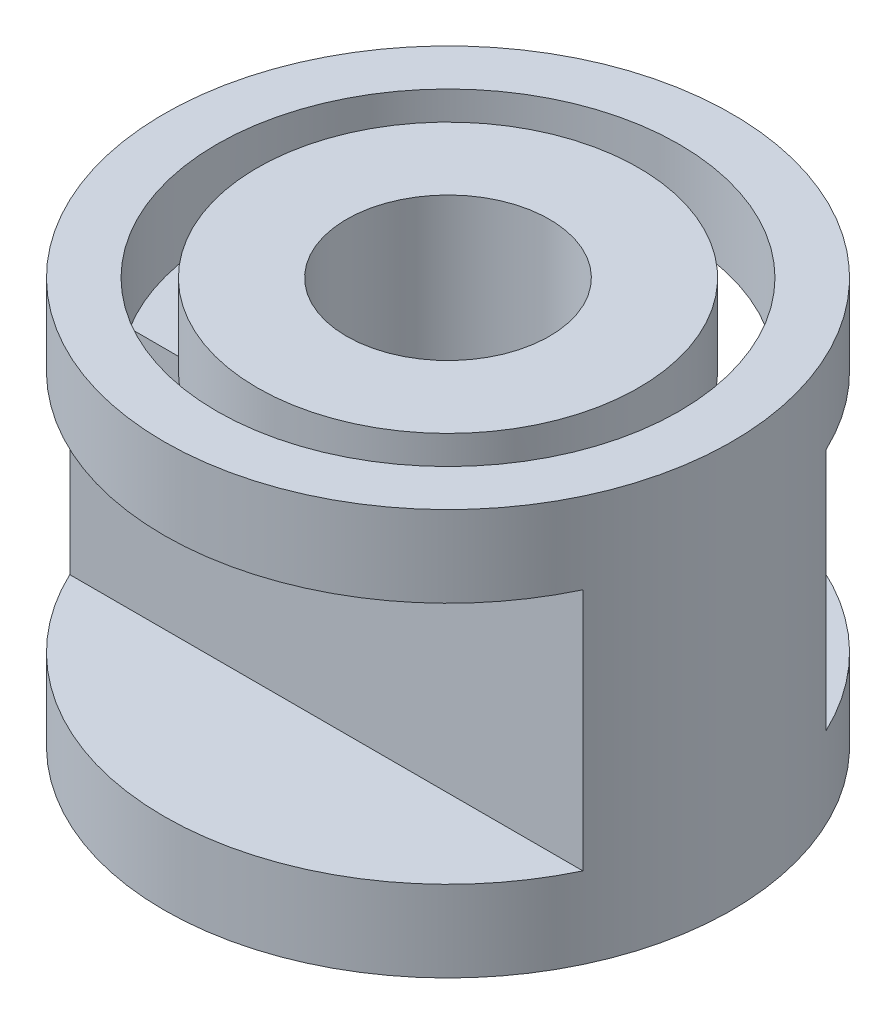
ISO-10303-21;
HEADER;
FILE_DESCRIPTION(('STEP AP214'),'2;1');
FILE_NAME('part.step','',(''),(''),'','','');
FILE_SCHEMA(('AUTOMOTIVE_DESIGN { 1 0 10303 214 1 1 1 1 }'));
ENDSEC;
DATA;
#1=APPLICATION_CONTEXT('core data for automotive mechanical design processes');
#2=APPLICATION_PROTOCOL_DEFINITION('international standard','automotive_design',2000,#1);
#3=PRODUCT_CONTEXT('',#1,'mechanical');
#4=PRODUCT('Part','Part','',(#3));
#5=PRODUCT_RELATED_PRODUCT_CATEGORY('part','',(#4));
#6=PRODUCT_DEFINITION_FORMATION('','',#4);
#7=PRODUCT_DEFINITION_CONTEXT('part definition',#1,'design');
#8=PRODUCT_DEFINITION('design','',#6,#7);
#9=PRODUCT_DEFINITION_SHAPE('','',#8);
#10=(LENGTH_UNIT() NAMED_UNIT(*) SI_UNIT(.MILLI.,.METRE.));
#11=(NAMED_UNIT(*) PLANE_ANGLE_UNIT() SI_UNIT($,.RADIAN.));
#12=(NAMED_UNIT(*) SI_UNIT($,.STERADIAN.) SOLID_ANGLE_UNIT());
#13=UNCERTAINTY_MEASURE_WITH_UNIT(LENGTH_MEASURE(1.E-05),#10,'distance_accuracy_value','');
#14=(GEOMETRIC_REPRESENTATION_CONTEXT(3) GLOBAL_UNCERTAINTY_ASSIGNED_CONTEXT((#13)) GLOBAL_UNIT_ASSIGNED_CONTEXT((#10,
#11,#12)) REPRESENTATION_CONTEXT('',''));
#15=CARTESIAN_POINT('',(0.,0.,0.));
#16=DIRECTION('',(0.,0.,1.));
#17=DIRECTION('',(1.,0.,0.));
#18=AXIS2_PLACEMENT_3D('',#15,#16,#17);
#19=CARTESIAN_POINT('',(0.,4.,0.));
#20=DIRECTION('',(0.,1.,0.));
#21=DIRECTION('',(0.,0.,1.));
#22=AXIS2_PLACEMENT_3D('',#19,#20,#21);
#23=PLANE('',#22);
#24=DIRECTION('',(1.,0.,0.));
#25=VECTOR('',#24,1.);
#26=CARTESIAN_POINT('',(-3.5,4.,-1.5));
#27=LINE('',#26,#25);
#28=CARTESIAN_POINT('',(-2.42332416321053,4.,-1.5));
#29=VERTEX_POINT('',#28);
#30=CARTESIAN_POINT('',(-1.80900525151256,4.,-1.5));
#31=VERTEX_POINT('',#30);
#32=EDGE_CURVE('E50',#29,#31,#27,.T.);
#33=ORIENTED_EDGE('',*,*,#32,.F.);
#34=CARTESIAN_POINT('',(0.,4.,0.));
#35=DIRECTION('',(0.,1.,0.));
#36=DIRECTION('',(0.,0.,1.));
#37=AXIS2_PLACEMENT_3D('',#34,#35,#36);
#38=CIRCLE('',#37,2.85);
#39=CARTESIAN_POINT('',(-2.42332416321053,4.,1.5));
#40=VERTEX_POINT('',#39);
#41=EDGE_CURVE('E153',#29,#40,#38,.T.);
#42=ORIENTED_EDGE('',*,*,#41,.T.);
#43=DIRECTION('',(1.,0.,0.));
#44=VECTOR('',#43,1.);
#45=CARTESIAN_POINT('',(-3.5,4.,1.5));
#46=LINE('',#45,#44);
#47=CARTESIAN_POINT('',(-1.80900525151256,4.,1.5));
#48=VERTEX_POINT('',#47);
#49=EDGE_CURVE('E336',#40,#48,#46,.T.);
#50=ORIENTED_EDGE('',*,*,#49,.T.);
#51=CARTESIAN_POINT('',(0.,4.,0.));
#52=DIRECTION('',(0.,1.,0.));
#53=DIRECTION('',(0.,0.,1.));
#54=AXIS2_PLACEMENT_3D('',#51,#52,#53);
#55=CIRCLE('',#54,2.35);
#56=EDGE_CURVE('E146',#31,#48,#55,.T.);
#57=ORIENTED_EDGE('',*,*,#56,.F.);
#58=EDGE_LOOP('',(#33,#42,#50,#57));
#59=FACE_BOUND('',#58,.T.);
#60=ADVANCED_FACE('F35',(#59),#23,.T.);
#61=CARTESIAN_POINT('',(1.80900525151256,4.,-1.5));
#62=VERTEX_POINT('',#61);
#63=CARTESIAN_POINT('',(2.42332416321053,4.,-1.5));
#64=VERTEX_POINT('',#63);
#65=EDGE_CURVE('E124',#62,#64,#27,.T.);
#66=ORIENTED_EDGE('',*,*,#65,.F.);
#67=CARTESIAN_POINT('',(1.80900525151255,4.,1.5));
#68=VERTEX_POINT('',#67);
#69=EDGE_CURVE('E141',#68,#62,#55,.T.);
#70=ORIENTED_EDGE('',*,*,#69,.F.);
#71=CARTESIAN_POINT('',(2.42332416321053,4.,1.5));
#72=VERTEX_POINT('',#71);
#73=EDGE_CURVE('E129',#68,#72,#46,.T.);
#74=ORIENTED_EDGE('',*,*,#73,.T.);
#75=EDGE_CURVE('E149',#72,#64,#38,.T.);
#76=ORIENTED_EDGE('',*,*,#75,.T.);
#77=EDGE_LOOP('',(#66,#70,#74,#76));
#78=FACE_BOUND('',#77,.T.);
#79=ADVANCED_FACE('F186',(#78),#23,.T.);
#80=CARTESIAN_POINT('',(0.,5.,0.));
#81=DIRECTION('',(0.,-1.,0.));
#82=DIRECTION('',(0.,0.,-1.));
#83=AXIS2_PLACEMENT_3D('',#80,#81,#82);
#84=CYLINDRICAL_SURFACE('',#83,3.5);
#85=DIRECTION('',(0.,-1.,0.));
#86=VECTOR('',#85,1.);
#87=CARTESIAN_POINT('',(3.16227766016838,5.,-1.5));
#88=LINE('',#87,#86);
#89=CARTESIAN_POINT('',(3.16227766016838,1.,-1.5));
#90=VERTEX_POINT('',#89);
#91=CARTESIAN_POINT('',(3.16227766016838,4.,-1.5));
#92=VERTEX_POINT('',#91);
#93=EDGE_CURVE('E43',#90,#92,#88,.F.);
#94=ORIENTED_EDGE('',*,*,#93,.T.);
#95=CARTESIAN_POINT('',(0.,4.,0.));
#96=DIRECTION('',(0.,1.,0.));
#97=DIRECTION('',(0.,0.,1.));
#98=AXIS2_PLACEMENT_3D('',#95,#96,#97);
#99=CIRCLE('',#98,3.5);
#100=CARTESIAN_POINT('',(-3.16227766016838,4.,-1.5));
#101=VERTEX_POINT('',#100);
#102=EDGE_CURVE('E102',#92,#101,#99,.T.);
#103=ORIENTED_EDGE('',*,*,#102,.T.);
#104=DIRECTION('',(0.,-1.,0.));
#105=VECTOR('',#104,1.);
#106=CARTESIAN_POINT('',(-3.16227766016838,5.,-1.5));
#107=LINE('',#106,#105);
#108=CARTESIAN_POINT('',(-3.16227766016838,1.,-1.5));
#109=VERTEX_POINT('',#108);
#110=EDGE_CURVE('E11',#101,#109,#107,.T.);
#111=ORIENTED_EDGE('',*,*,#110,.T.);
#112=CARTESIAN_POINT('',(0.,1.,0.));
#113=DIRECTION('',(0.,-1.,0.));
#114=DIRECTION('',(0.,0.,-1.));
#115=AXIS2_PLACEMENT_3D('',#112,#113,#114);
#116=CIRCLE('',#115,3.5);
#117=EDGE_CURVE('E173',#109,#90,#116,.T.);
#118=ORIENTED_EDGE('',*,*,#117,.T.);
#119=EDGE_LOOP('',(#94,#103,#111,#118));
#120=FACE_BOUND('',#119,.T.);
#121=CARTESIAN_POINT('',(0.,4.,0.));
#122=DIRECTION('',(0.,1.,0.));
#123=DIRECTION('',(0.,0.,1.));
#124=AXIS2_PLACEMENT_3D('',#121,#122,#123);
#125=CIRCLE('',#124,3.5);
#126=CARTESIAN_POINT('',(-3.16227766016838,4.,1.5));
#127=VERTEX_POINT('',#126);
#128=CARTESIAN_POINT('',(3.16227766016838,4.,1.5));
#129=VERTEX_POINT('',#128);
#130=EDGE_CURVE('E171',#127,#129,#125,.T.);
#131=ORIENTED_EDGE('',*,*,#130,.T.);
#132=DIRECTION('',(0.,-1.,0.));
#133=VECTOR('',#132,1.);
#134=CARTESIAN_POINT('',(3.16227766016838,5.,1.5));
#135=LINE('',#134,#133);
#136=CARTESIAN_POINT('',(3.16227766016838,1.,1.5));
#137=VERTEX_POINT('',#136);
#138=EDGE_CURVE('E168',#129,#137,#135,.T.);
#139=ORIENTED_EDGE('',*,*,#138,.T.);
#140=CARTESIAN_POINT('',(0.,1.,0.));
#141=DIRECTION('',(0.,-1.,0.));
#142=DIRECTION('',(0.,0.,-1.));
#143=AXIS2_PLACEMENT_3D('',#140,#141,#142);
#144=CIRCLE('',#143,3.5);
#145=CARTESIAN_POINT('',(-3.16227766016838,1.,1.5));
#146=VERTEX_POINT('',#145);
#147=EDGE_CURVE('E160',#137,#146,#144,.T.);
#148=ORIENTED_EDGE('',*,*,#147,.T.);
#149=DIRECTION('',(0.,-1.,0.));
#150=VECTOR('',#149,1.);
#151=CARTESIAN_POINT('',(-3.16227766016838,5.,1.5));
#152=LINE('',#151,#150);
#153=EDGE_CURVE('E165',#146,#127,#152,.F.);
#154=ORIENTED_EDGE('',*,*,#153,.T.);
#155=EDGE_LOOP('',(#131,#139,#148,#154));
#156=FACE_BOUND('',#155,.T.);
#157=CARTESIAN_POINT('',(0.,5.,0.));
#158=DIRECTION('',(0.,1.,0.));
#159=DIRECTION('',(0.,0.,1.));
#160=AXIS2_PLACEMENT_3D('',#157,#158,#159);
#161=CIRCLE('',#160,3.5);
#162=CARTESIAN_POINT('',(0.,5.,3.5));
#163=VERTEX_POINT('',#162);
#164=EDGE_CURVE('E157',#163,#163,#161,.T.);
#165=ORIENTED_EDGE('',*,*,#164,.F.);
#166=EDGE_LOOP('',(#165));
#167=FACE_BOUND('',#166,.T.);
#168=CARTESIAN_POINT('',(0.,0.,0.));
#169=DIRECTION('',(0.,1.,0.));
#170=DIRECTION('',(0.,0.,1.));
#171=AXIS2_PLACEMENT_3D('',#168,#169,#170);
#172=CIRCLE('',#171,3.5);
#173=CARTESIAN_POINT('',(0.,0.,3.5));
#174=VERTEX_POINT('',#173);
#175=EDGE_CURVE('E152',#174,#174,#172,.T.);
#176=ORIENTED_EDGE('',*,*,#175,.T.);
#177=EDGE_LOOP('',(#176));
#178=FACE_BOUND('',#177,.T.);
#179=ADVANCED_FACE('F37',(#120,#156,#167,#178),#84,.T.);
#180=CARTESIAN_POINT('',(0.,5.,0.));
#181=DIRECTION('',(0.,1.,0.));
#182=DIRECTION('',(0.,0.,1.));
#183=AXIS2_PLACEMENT_3D('',#180,#181,#182);
#184=PLANE('',#183);
#185=CARTESIAN_POINT('',(0.,5.,0.));
#186=DIRECTION('',(0.,1.,0.));
#187=DIRECTION('',(0.,0.,1.));
#188=AXIS2_PLACEMENT_3D('',#185,#186,#187);
#189=CIRCLE('',#188,2.85);
#190=CARTESIAN_POINT('',(0.,5.,2.85));
#191=VERTEX_POINT('',#190);
#192=EDGE_CURVE('E144',#191,#191,#189,.T.);
#193=ORIENTED_EDGE('',*,*,#192,.F.);
#194=EDGE_LOOP('',(#193));
#195=FACE_BOUND('',#194,.T.);
#196=ORIENTED_EDGE('',*,*,#164,.T.);
#197=EDGE_LOOP('',(#196));
#198=FACE_BOUND('',#197,.T.);
#199=ADVANCED_FACE('F202',(#195,#198),#184,.T.);
#200=CARTESIAN_POINT('',(0.,0.,0.));
#201=DIRECTION('',(0.,1.,0.));
#202=DIRECTION('',(0.,0.,1.));
#203=AXIS2_PLACEMENT_3D('',#200,#201,#202);
#204=PLANE('',#203);
#205=CARTESIAN_POINT('',(0.,0.,0.));
#206=DIRECTION('',(0.,1.,0.));
#207=DIRECTION('',(0.,0.,1.));
#208=AXIS2_PLACEMENT_3D('',#205,#206,#207);
#209=CIRCLE('',#208,1.25);
#210=CARTESIAN_POINT('',(0.,0.,1.25));
#211=VERTEX_POINT('',#210);
#212=EDGE_CURVE('E133',#211,#211,#209,.T.);
#213=ORIENTED_EDGE('',*,*,#212,.T.);
#214=EDGE_LOOP('',(#213));
#215=FACE_BOUND('',#214,.T.);
#216=ORIENTED_EDGE('',*,*,#175,.F.);
#217=EDGE_LOOP('',(#216));
#218=FACE_BOUND('',#217,.T.);
#219=ADVANCED_FACE('F200',(#215,#218),#204,.F.);
#220=CARTESIAN_POINT('',(0.,4.,0.));
#221=DIRECTION('',(0.,1.,0.));
#222=DIRECTION('',(0.,0.,1.));
#223=AXIS2_PLACEMENT_3D('',#220,#221,#222);
#224=CYLINDRICAL_SURFACE('',#223,2.85);
#225=ORIENTED_EDGE('',*,*,#75,.F.);
#226=EDGE_CURVE('E154',#40,#72,#38,.T.);
#227=ORIENTED_EDGE('',*,*,#226,.F.);
#228=ORIENTED_EDGE('',*,*,#41,.F.);
#229=CARTESIAN_POINT('',(0.,4.,0.));
#230=DIRECTION('',(0.,1.,0.));
#231=DIRECTION('',(0.,0.,1.));
#232=AXIS2_PLACEMENT_3D('',#229,#230,#231);
#233=CIRCLE('',#232,2.85);
#234=EDGE_CURVE('E110',#29,#64,#233,.F.);
#235=ORIENTED_EDGE('',*,*,#234,.T.);
#236=EDGE_LOOP('',(#225,#227,#228,#235));
#237=FACE_BOUND('',#236,.T.);
#238=ORIENTED_EDGE('',*,*,#192,.T.);
#239=EDGE_LOOP('',(#238));
#240=FACE_BOUND('',#239,.T.);
#241=ADVANCED_FACE('F197',(#237,#240),#224,.F.);
#242=CARTESIAN_POINT('',(0.,4.,0.));
#243=DIRECTION('',(0.,1.,0.));
#244=DIRECTION('',(0.,0.,1.));
#245=AXIS2_PLACEMENT_3D('',#242,#243,#244);
#246=CYLINDRICAL_SURFACE('',#245,2.35);
#247=ORIENTED_EDGE('',*,*,#69,.T.);
#248=EDGE_CURVE('E145',#62,#31,#55,.T.);
#249=ORIENTED_EDGE('',*,*,#248,.T.);
#250=ORIENTED_EDGE('',*,*,#56,.T.);
#251=EDGE_CURVE('E140',#48,#68,#55,.T.);
#252=ORIENTED_EDGE('',*,*,#251,.T.);
#253=EDGE_LOOP('',(#247,#249,#250,#252));
#254=FACE_BOUND('',#253,.T.);
#255=CARTESIAN_POINT('',(0.,5.,0.));
#256=DIRECTION('',(0.,1.,0.));
#257=DIRECTION('',(0.,0.,1.));
#258=AXIS2_PLACEMENT_3D('',#255,#256,#257);
#259=CIRCLE('',#258,2.35);
#260=CARTESIAN_POINT('',(0.,5.,2.35));
#261=VERTEX_POINT('',#260);
#262=EDGE_CURVE('E136',#261,#261,#259,.T.);
#263=ORIENTED_EDGE('',*,*,#262,.F.);
#264=EDGE_LOOP('',(#263));
#265=FACE_BOUND('',#264,.T.);
#266=ADVANCED_FACE('F195',(#254,#265),#246,.T.);
#267=CARTESIAN_POINT('',(0.,5.,0.));
#268=DIRECTION('',(0.,1.,0.));
#269=DIRECTION('',(0.,0.,1.));
#270=AXIS2_PLACEMENT_3D('',#267,#268,#269);
#271=CIRCLE('',#270,1.25);
#272=CARTESIAN_POINT('',(0.,5.,1.25));
#273=VERTEX_POINT('',#272);
#274=EDGE_CURVE('E137',#273,#273,#271,.T.);
#275=ORIENTED_EDGE('',*,*,#274,.F.);
#276=EDGE_LOOP('',(#275));
#277=FACE_BOUND('',#276,.T.);
#278=ORIENTED_EDGE('',*,*,#262,.T.);
#279=EDGE_LOOP('',(#278));
#280=FACE_BOUND('',#279,.T.);
#281=ADVANCED_FACE('F205',(#277,#280),#184,.T.);
#282=CARTESIAN_POINT('',(0.,0.,0.));
#283=DIRECTION('',(0.,1.,0.));
#284=DIRECTION('',(0.,0.,1.));
#285=AXIS2_PLACEMENT_3D('',#282,#283,#284);
#286=CYLINDRICAL_SURFACE('',#285,1.25);
#287=ORIENTED_EDGE('',*,*,#212,.F.);
#288=EDGE_LOOP('',(#287));
#289=FACE_BOUND('',#288,.T.);
#290=ORIENTED_EDGE('',*,*,#274,.T.);
#291=EDGE_LOOP('',(#290));
#292=FACE_BOUND('',#291,.T.);
#293=ADVANCED_FACE('F241',(#289,#292),#286,.F.);
#294=CARTESIAN_POINT('',(-3.5,4.,3.5));
#295=DIRECTION('',(0.,1.,0.));
#296=DIRECTION('',(0.,0.,1.));
#297=AXIS2_PLACEMENT_3D('',#294,#295,#296);
#298=PLANE('',#297);
#299=EDGE_CURVE('E342',#48,#68,#46,.T.);
#300=ORIENTED_EDGE('',*,*,#299,.T.);
#301=ORIENTED_EDGE('',*,*,#251,.F.);
#302=EDGE_LOOP('',(#300,#301));
#303=FACE_BOUND('',#302,.T.);
#304=ADVANCED_FACE('F252',(#303),#298,.F.);
#305=ORIENTED_EDGE('',*,*,#226,.T.);
#306=EDGE_CURVE('E58',#72,#129,#46,.T.);
#307=ORIENTED_EDGE('',*,*,#306,.T.);
#308=ORIENTED_EDGE('',*,*,#130,.F.);
#309=EDGE_CURVE('E130',#127,#40,#46,.T.);
#310=ORIENTED_EDGE('',*,*,#309,.T.);
#311=EDGE_LOOP('',(#305,#307,#308,#310));
#312=FACE_BOUND('',#311,.T.);
#313=ADVANCED_FACE('F272',(#312),#298,.F.);
#314=CARTESIAN_POINT('',(-3.5,1.,1.5));
#315=DIRECTION('',(0.,0.,-1.));
#316=DIRECTION('',(-1.,0.,0.));
#317=AXIS2_PLACEMENT_3D('',#314,#315,#316);
#318=PLANE('',#317);
#319=ORIENTED_EDGE('',*,*,#306,.F.);
#320=ORIENTED_EDGE('',*,*,#73,.F.);
#321=ORIENTED_EDGE('',*,*,#299,.F.);
#322=ORIENTED_EDGE('',*,*,#49,.F.);
#323=ORIENTED_EDGE('',*,*,#309,.F.);
#324=ORIENTED_EDGE('',*,*,#153,.F.);
#325=DIRECTION('',(1.,0.,0.));
#326=VECTOR('',#325,1.);
#327=CARTESIAN_POINT('',(-3.5,1.,1.5));
#328=LINE('',#327,#326);
#329=EDGE_CURVE('E109',#146,#137,#328,.T.);
#330=ORIENTED_EDGE('',*,*,#329,.T.);
#331=ORIENTED_EDGE('',*,*,#138,.F.);
#332=EDGE_LOOP('',(#319,#320,#321,#322,#323,#324,#330,#331));
#333=FACE_BOUND('',#332,.T.);
#334=ADVANCED_FACE('F282',(#333),#318,.F.);
#335=CARTESIAN_POINT('',(-3.5,1.,3.5));
#336=DIRECTION('',(0.,-1.,0.));
#337=DIRECTION('',(0.,0.,-1.));
#338=AXIS2_PLACEMENT_3D('',#335,#336,#337);
#339=PLANE('',#338);
#340=ORIENTED_EDGE('',*,*,#329,.F.);
#341=ORIENTED_EDGE('',*,*,#147,.F.);
#342=EDGE_LOOP('',(#340,#341));
#343=FACE_BOUND('',#342,.T.);
#344=ADVANCED_FACE('F183',(#343),#339,.F.);
#345=CARTESIAN_POINT('',(-3.5,4.,-1.5));
#346=DIRECTION('',(0.,0.,1.));
#347=DIRECTION('',(0.,-1.,0.));
#348=AXIS2_PLACEMENT_3D('',#345,#346,#347);
#349=PLANE('',#348);
#350=EDGE_CURVE('E114',#101,#29,#27,.T.);
#351=ORIENTED_EDGE('',*,*,#350,.T.);
#352=ORIENTED_EDGE('',*,*,#32,.T.);
#353=EDGE_CURVE('E122',#31,#62,#27,.T.);
#354=ORIENTED_EDGE('',*,*,#353,.T.);
#355=ORIENTED_EDGE('',*,*,#65,.T.);
#356=EDGE_CURVE('E120',#64,#92,#27,.T.);
#357=ORIENTED_EDGE('',*,*,#356,.T.);
#358=ORIENTED_EDGE('',*,*,#93,.F.);
#359=DIRECTION('',(1.,0.,0.));
#360=VECTOR('',#359,1.);
#361=CARTESIAN_POINT('',(-3.5,1.,-1.5));
#362=LINE('',#361,#360);
#363=EDGE_CURVE('E116',#109,#90,#362,.T.);
#364=ORIENTED_EDGE('',*,*,#363,.F.);
#365=ORIENTED_EDGE('',*,*,#110,.F.);
#366=EDGE_LOOP('',(#351,#352,#354,#355,#357,#358,#364,#365));
#367=FACE_BOUND('',#366,.T.);
#368=ADVANCED_FACE('F113',(#367),#349,.F.);
#369=CARTESIAN_POINT('',(-3.5,1.,-1.5));
#370=DIRECTION('',(0.,-1.,0.));
#371=DIRECTION('',(0.,0.,-1.));
#372=AXIS2_PLACEMENT_3D('',#369,#370,#371);
#373=PLANE('',#372);
#374=ORIENTED_EDGE('',*,*,#117,.F.);
#375=ORIENTED_EDGE('',*,*,#363,.T.);
#376=EDGE_LOOP('',(#374,#375));
#377=FACE_BOUND('',#376,.T.);
#378=ADVANCED_FACE('F174',(#377),#373,.F.);
#379=CARTESIAN_POINT('',(-3.5,4.,-1.5));
#380=DIRECTION('',(0.,1.,0.));
#381=DIRECTION('',(0.,0.,1.));
#382=AXIS2_PLACEMENT_3D('',#379,#380,#381);
#383=PLANE('',#382);
#384=ORIENTED_EDGE('',*,*,#356,.F.);
#385=ORIENTED_EDGE('',*,*,#234,.F.);
#386=ORIENTED_EDGE('',*,*,#350,.F.);
#387=ORIENTED_EDGE('',*,*,#102,.F.);
#388=EDGE_LOOP('',(#384,#385,#386,#387));
#389=FACE_BOUND('',#388,.T.);
#390=ADVANCED_FACE('F117',(#389),#383,.F.);
#391=ORIENTED_EDGE('',*,*,#248,.F.);
#392=ORIENTED_EDGE('',*,*,#353,.F.);
#393=EDGE_LOOP('',(#391,#392));
#394=FACE_BOUND('',#393,.T.);
#395=ADVANCED_FACE('F181',(#394),#383,.F.);
#396=CLOSED_SHELL('',(#60,#79,#179,#199,#219,#241,#266,#281,#293,#304,#313,#334,#344,#368,#378,
#390,#395));
#397=MANIFOLD_SOLID_BREP('B2',#396);
#398=ADVANCED_BREP_SHAPE_REPRESENTATION('',(#18,#397),#14);
#399=SHAPE_DEFINITION_REPRESENTATION(#9,#398);
ENDSEC;
END-ISO-10303-21;
